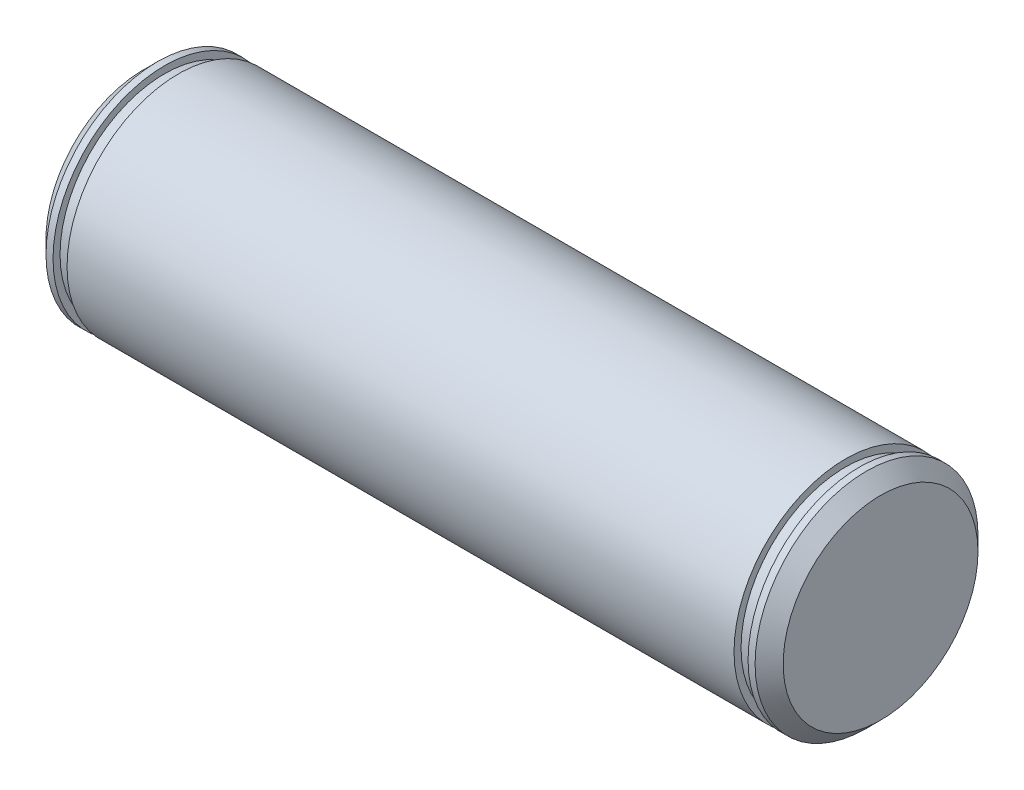
ISO-10303-21;
HEADER;
FILE_DESCRIPTION(('STEP AP214'),'2;1');
FILE_NAME('part.step','',(''),(''),'','','');
FILE_SCHEMA(('AUTOMOTIVE_DESIGN { 1 0 10303 214 1 1 1 1 }'));
ENDSEC;
DATA;
#1=APPLICATION_CONTEXT('core data for automotive mechanical design processes');
#2=APPLICATION_PROTOCOL_DEFINITION('international standard','automotive_design',2000,#1);
#3=PRODUCT_CONTEXT('',#1,'mechanical');
#4=PRODUCT('Part','Part','',(#3));
#5=PRODUCT_RELATED_PRODUCT_CATEGORY('part','',(#4));
#6=PRODUCT_DEFINITION_FORMATION('','',#4);
#7=PRODUCT_DEFINITION_CONTEXT('part definition',#1,'design');
#8=PRODUCT_DEFINITION('design','',#6,#7);
#9=PRODUCT_DEFINITION_SHAPE('','',#8);
#10=(LENGTH_UNIT() NAMED_UNIT(*) SI_UNIT(.MILLI.,.METRE.));
#11=(NAMED_UNIT(*) PLANE_ANGLE_UNIT() SI_UNIT($,.RADIAN.));
#12=(NAMED_UNIT(*) SI_UNIT($,.STERADIAN.) SOLID_ANGLE_UNIT());
#13=UNCERTAINTY_MEASURE_WITH_UNIT(LENGTH_MEASURE(1.E-05),#10,'distance_accuracy_value','');
#14=(GEOMETRIC_REPRESENTATION_CONTEXT(3) GLOBAL_UNCERTAINTY_ASSIGNED_CONTEXT((#13)) GLOBAL_UNIT_ASSIGNED_CONTEXT((#10,
#11,#12)) REPRESENTATION_CONTEXT('',''));
#15=CARTESIAN_POINT('',(0.,0.,0.));
#16=DIRECTION('',(0.,0.,1.));
#17=DIRECTION('',(1.,0.,0.));
#18=AXIS2_PLACEMENT_3D('',#15,#16,#17);
#19=CARTESIAN_POINT('',(52.5,0.,0.));
#20=DIRECTION('',(-1.,0.,0.));
#21=DIRECTION('',(0.,0.,1.));
#22=AXIS2_PLACEMENT_3D('',#19,#20,#21);
#23=CYLINDRICAL_SURFACE('',#22,15.875);
#24=CARTESIAN_POINT('',(-47.5,0.,0.));
#25=DIRECTION('',(-1.,0.,0.));
#26=DIRECTION('',(0.,0.,1.));
#27=AXIS2_PLACEMENT_3D('',#24,#25,#26);
#28=CIRCLE('',#27,15.875);
#29=CARTESIAN_POINT('',(-47.5,0.,15.875));
#30=VERTEX_POINT('',#29);
#31=EDGE_CURVE('E52',#30,#30,#28,.T.);
#32=ORIENTED_EDGE('',*,*,#31,.F.);
#33=EDGE_LOOP('',(#32));
#34=FACE_BOUND('',#33,.T.);
#35=CARTESIAN_POINT('',(47.5,0.,0.));
#36=DIRECTION('',(-1.,0.,0.));
#37=DIRECTION('',(0.,0.,1.));
#38=AXIS2_PLACEMENT_3D('',#35,#36,#37);
#39=CIRCLE('',#38,15.875);
#40=CARTESIAN_POINT('',(47.5,0.,15.875));
#41=VERTEX_POINT('',#40);
#42=EDGE_CURVE('E64',#41,#41,#39,.T.);
#43=ORIENTED_EDGE('',*,*,#42,.T.);
#44=EDGE_LOOP('',(#43));
#45=FACE_BOUND('',#44,.T.);
#46=ADVANCED_FACE('F31',(#34,#45),#23,.T.);
#47=CARTESIAN_POINT('',(-49.5,0.,0.));
#48=DIRECTION('',(-1.,0.,0.));
#49=DIRECTION('',(0.,0.,1.));
#50=AXIS2_PLACEMENT_3D('',#47,#48,#49);
#51=CIRCLE('',#50,15.875);
#52=CARTESIAN_POINT('',(-49.5,0.,15.875));
#53=VERTEX_POINT('',#52);
#54=EDGE_CURVE('E51',#53,#53,#51,.T.);
#55=ORIENTED_EDGE('',*,*,#54,.T.);
#56=EDGE_LOOP('',(#55));
#57=FACE_BOUND('',#56,.T.);
#58=CARTESIAN_POINT('',(-50.5,0.,0.));
#59=DIRECTION('',(1.,0.,0.));
#60=DIRECTION('',(0.,0.,-1.));
#61=AXIS2_PLACEMENT_3D('',#58,#59,#60);
#62=CIRCLE('',#61,15.875);
#63=CARTESIAN_POINT('',(-50.5,0.,-15.875));
#64=VERTEX_POINT('',#63);
#65=EDGE_CURVE('E42',#64,#64,#62,.T.);
#66=ORIENTED_EDGE('',*,*,#65,.T.);
#67=EDGE_LOOP('',(#66));
#68=FACE_BOUND('',#67,.T.);
#69=ADVANCED_FACE('F91',(#57,#68),#23,.T.);
#70=CARTESIAN_POINT('',(-52.5,0.,0.));
#71=DIRECTION('',(1.,0.,0.));
#72=DIRECTION('',(0.,0.,-1.));
#73=AXIS2_PLACEMENT_3D('',#70,#71,#72);
#74=PLANE('',#73);
#75=CARTESIAN_POINT('',(-52.5,0.,0.));
#76=DIRECTION('',(1.,0.,0.));
#77=DIRECTION('',(0.,0.,-1.));
#78=AXIS2_PLACEMENT_3D('',#75,#76,#77);
#79=CIRCLE('',#78,13.875);
#80=CARTESIAN_POINT('',(-52.5,0.,-13.875));
#81=VERTEX_POINT('',#80);
#82=EDGE_CURVE('E38',#81,#81,#79,.F.);
#83=ORIENTED_EDGE('',*,*,#82,.T.);
#84=EDGE_LOOP('',(#83));
#85=FACE_BOUND('',#84,.T.);
#86=ADVANCED_FACE('F106',(#85),#74,.F.);
#87=CARTESIAN_POINT('',(-50.5,0.,0.));
#88=DIRECTION('',(1.,0.,0.));
#89=DIRECTION('',(0.,0.,-1.));
#90=AXIS2_PLACEMENT_3D('',#87,#88,#89);
#91=CONICAL_SURFACE('',#90,15.875,0.785398163397452);
#92=ORIENTED_EDGE('',*,*,#82,.F.);
#93=EDGE_LOOP('',(#92));
#94=FACE_BOUND('',#93,.T.);
#95=ORIENTED_EDGE('',*,*,#65,.F.);
#96=EDGE_LOOP('',(#95));
#97=FACE_BOUND('',#96,.T.);
#98=ADVANCED_FACE('F111',(#94,#97),#91,.T.);
#99=CARTESIAN_POINT('',(-49.5,0.,0.));
#100=DIRECTION('',(-1.,0.,0.));
#101=DIRECTION('',(0.,0.,1.));
#102=AXIS2_PLACEMENT_3D('',#99,#100,#101);
#103=PLANE('',#102);
#104=ORIENTED_EDGE('',*,*,#54,.F.);
#105=EDGE_LOOP('',(#104));
#106=FACE_BOUND('',#105,.T.);
#107=CARTESIAN_POINT('',(-49.5,0.,0.));
#108=DIRECTION('',(-1.,0.,0.));
#109=DIRECTION('',(0.,0.,1.));
#110=AXIS2_PLACEMENT_3D('',#107,#108,#109);
#111=CIRCLE('',#110,14.875);
#112=CARTESIAN_POINT('',(-49.5,0.,14.875));
#113=VERTEX_POINT('',#112);
#114=EDGE_CURVE('E55',#113,#113,#111,.T.);
#115=ORIENTED_EDGE('',*,*,#114,.T.);
#116=EDGE_LOOP('',(#115));
#117=FACE_BOUND('',#116,.T.);
#118=ADVANCED_FACE('F113',(#106,#117),#103,.F.);
#119=CARTESIAN_POINT('',(-47.5,0.,0.));
#120=DIRECTION('',(-1.,0.,0.));
#121=DIRECTION('',(0.,0.,1.));
#122=AXIS2_PLACEMENT_3D('',#119,#120,#121);
#123=PLANE('',#122);
#124=ORIENTED_EDGE('',*,*,#31,.T.);
#125=EDGE_LOOP('',(#124));
#126=FACE_BOUND('',#125,.T.);
#127=CARTESIAN_POINT('',(-47.5,0.,0.));
#128=DIRECTION('',(-1.,0.,0.));
#129=DIRECTION('',(0.,0.,1.));
#130=AXIS2_PLACEMENT_3D('',#127,#128,#129);
#131=CIRCLE('',#130,14.875);
#132=CARTESIAN_POINT('',(-47.5,0.,14.875));
#133=VERTEX_POINT('',#132);
#134=EDGE_CURVE('E58',#133,#133,#131,.T.);
#135=ORIENTED_EDGE('',*,*,#134,.F.);
#136=EDGE_LOOP('',(#135));
#137=FACE_BOUND('',#136,.T.);
#138=ADVANCED_FACE('F119',(#126,#137),#123,.T.);
#139=CARTESIAN_POINT('',(-49.5,0.,0.));
#140=DIRECTION('',(1.,0.,0.));
#141=DIRECTION('',(0.,0.,-1.));
#142=AXIS2_PLACEMENT_3D('',#139,#140,#141);
#143=CYLINDRICAL_SURFACE('',#142,14.875);
#144=ORIENTED_EDGE('',*,*,#114,.F.);
#145=EDGE_LOOP('',(#144));
#146=FACE_BOUND('',#145,.T.);
#147=ORIENTED_EDGE('',*,*,#134,.T.);
#148=EDGE_LOOP('',(#147));
#149=FACE_BOUND('',#148,.T.);
#150=ADVANCED_FACE('F83',(#146,#149),#143,.T.);
#151=CARTESIAN_POINT('',(49.5,0.,0.));
#152=DIRECTION('',(1.,0.,0.));
#153=DIRECTION('',(0.,0.,1.));
#154=AXIS2_PLACEMENT_3D('',#151,#152,#153);
#155=PLANE('',#154);
#156=CARTESIAN_POINT('',(49.5,0.,0.));
#157=DIRECTION('',(-1.,0.,0.));
#158=DIRECTION('',(0.,0.,1.));
#159=AXIS2_PLACEMENT_3D('',#156,#157,#158);
#160=CIRCLE('',#159,14.875);
#161=CARTESIAN_POINT('',(49.5,0.,14.875));
#162=VERTEX_POINT('',#161);
#163=EDGE_CURVE('E67',#162,#162,#160,.T.);
#164=ORIENTED_EDGE('',*,*,#163,.F.);
#165=EDGE_LOOP('',(#164));
#166=FACE_BOUND('',#165,.T.);
#167=CARTESIAN_POINT('',(49.5,0.,0.));
#168=DIRECTION('',(-1.,0.,0.));
#169=DIRECTION('',(0.,0.,1.));
#170=AXIS2_PLACEMENT_3D('',#167,#168,#169);
#171=CIRCLE('',#170,15.875);
#172=CARTESIAN_POINT('',(49.5,0.,15.875));
#173=VERTEX_POINT('',#172);
#174=EDGE_CURVE('E61',#173,#173,#171,.T.);
#175=ORIENTED_EDGE('',*,*,#174,.T.);
#176=EDGE_LOOP('',(#175));
#177=FACE_BOUND('',#176,.T.);
#178=ADVANCED_FACE('F79',(#166,#177),#155,.F.);
#179=CARTESIAN_POINT('',(47.5,0.,0.));
#180=DIRECTION('',(1.,0.,0.));
#181=DIRECTION('',(0.,0.,1.));
#182=AXIS2_PLACEMENT_3D('',#179,#180,#181);
#183=PLANE('',#182);
#184=CARTESIAN_POINT('',(47.5,0.,0.));
#185=DIRECTION('',(-1.,0.,0.));
#186=DIRECTION('',(0.,0.,1.));
#187=AXIS2_PLACEMENT_3D('',#184,#185,#186);
#188=CIRCLE('',#187,14.875);
#189=CARTESIAN_POINT('',(47.5,0.,14.875));
#190=VERTEX_POINT('',#189);
#191=EDGE_CURVE('E70',#190,#190,#188,.T.);
#192=ORIENTED_EDGE('',*,*,#191,.T.);
#193=EDGE_LOOP('',(#192));
#194=FACE_BOUND('',#193,.T.);
#195=ORIENTED_EDGE('',*,*,#42,.F.);
#196=EDGE_LOOP('',(#195));
#197=FACE_BOUND('',#196,.T.);
#198=ADVANCED_FACE('F82',(#194,#197),#183,.T.);
#199=CARTESIAN_POINT('',(49.5,0.,0.));
#200=DIRECTION('',(-1.,0.,0.));
#201=DIRECTION('',(0.,0.,1.));
#202=AXIS2_PLACEMENT_3D('',#199,#200,#201);
#203=CYLINDRICAL_SURFACE('',#202,14.875);
#204=ORIENTED_EDGE('',*,*,#163,.T.);
#205=EDGE_LOOP('',(#204));
#206=FACE_BOUND('',#205,.T.);
#207=ORIENTED_EDGE('',*,*,#191,.F.);
#208=EDGE_LOOP('',(#207));
#209=FACE_BOUND('',#208,.T.);
#210=ADVANCED_FACE('F76',(#206,#209),#203,.T.);
#211=CARTESIAN_POINT('',(52.5,0.,0.));
#212=DIRECTION('',(1.,0.,0.));
#213=DIRECTION('',(0.,0.,-1.));
#214=AXIS2_PLACEMENT_3D('',#211,#212,#213);
#215=PLANE('',#214);
#216=CARTESIAN_POINT('',(52.5,0.,0.));
#217=DIRECTION('',(1.,0.,0.));
#218=DIRECTION('',(0.,0.,-1.));
#219=AXIS2_PLACEMENT_3D('',#216,#217,#218);
#220=CIRCLE('',#219,13.875);
#221=CARTESIAN_POINT('',(52.5,0.,-13.875));
#222=VERTEX_POINT('',#221);
#223=EDGE_CURVE('E10',#222,#222,#220,.T.);
#224=ORIENTED_EDGE('',*,*,#223,.T.);
#225=EDGE_LOOP('',(#224));
#226=FACE_BOUND('',#225,.T.);
#227=ADVANCED_FACE('F96',(#226),#215,.T.);
#228=CARTESIAN_POINT('',(52.5,0.,0.));
#229=DIRECTION('',(-1.,0.,0.));
#230=DIRECTION('',(0.,0.,1.));
#231=AXIS2_PLACEMENT_3D('',#228,#229,#230);
#232=CONICAL_SURFACE('',#231,13.875,0.785398163397443);
#233=CARTESIAN_POINT('',(50.5,0.,0.));
#234=DIRECTION('',(1.,0.,0.));
#235=DIRECTION('',(0.,0.,-1.));
#236=AXIS2_PLACEMENT_3D('',#233,#234,#235);
#237=CIRCLE('',#236,15.875);
#238=CARTESIAN_POINT('',(50.5,0.,-15.875));
#239=VERTEX_POINT('',#238);
#240=EDGE_CURVE('E46',#239,#239,#237,.F.);
#241=ORIENTED_EDGE('',*,*,#240,.F.);
#242=EDGE_LOOP('',(#241));
#243=FACE_BOUND('',#242,.T.);
#244=ORIENTED_EDGE('',*,*,#223,.F.);
#245=EDGE_LOOP('',(#244));
#246=FACE_BOUND('',#245,.T.);
#247=ADVANCED_FACE('F33',(#243,#246),#232,.T.);
#248=ORIENTED_EDGE('',*,*,#174,.F.);
#249=EDGE_LOOP('',(#248));
#250=FACE_BOUND('',#249,.T.);
#251=ORIENTED_EDGE('',*,*,#240,.T.);
#252=EDGE_LOOP('',(#251));
#253=FACE_BOUND('',#252,.T.);
#254=ADVANCED_FACE('F87',(#250,#253),#23,.T.);
#255=CLOSED_SHELL('',(#46,#69,#86,#98,#118,#138,#150,#178,#198,#210,#227,#247,#254));
#256=MANIFOLD_SOLID_BREP('B2',#255);
#257=ADVANCED_BREP_SHAPE_REPRESENTATION('',(#18,#256),#14);
#258=SHAPE_DEFINITION_REPRESENTATION(#9,#257);
ENDSEC;
END-ISO-10303-21;
